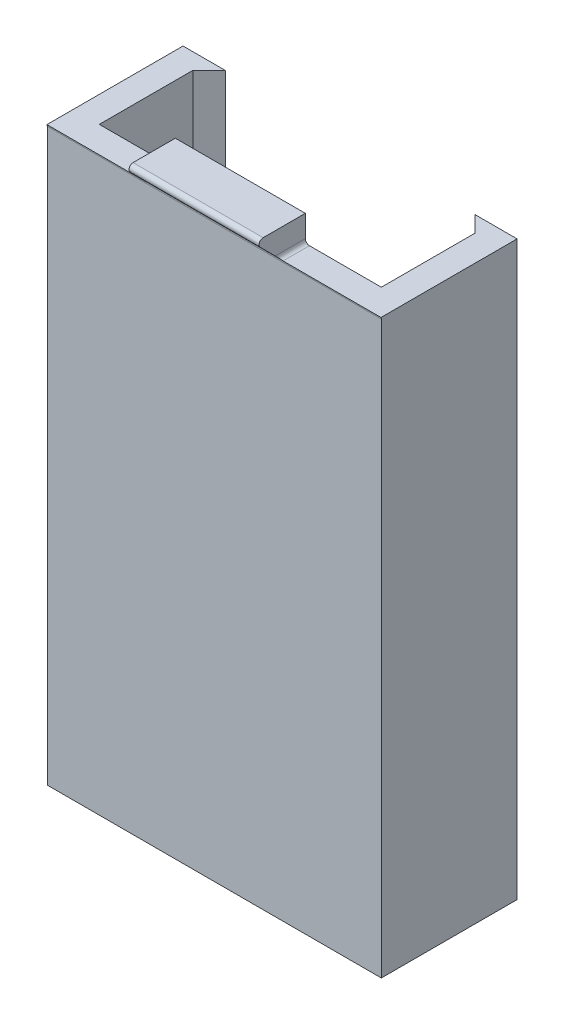
ISO-10303-21;
HEADER;
FILE_DESCRIPTION(('STEP AP214'),'2;1');
FILE_NAME('part.step','',(''),(''),'','','');
FILE_SCHEMA(('AUTOMOTIVE_DESIGN { 1 0 10303 214 1 1 1 1 }'));
ENDSEC;
DATA;
#1=APPLICATION_CONTEXT('core data for automotive mechanical design processes');
#2=APPLICATION_PROTOCOL_DEFINITION('international standard','automotive_design',2000,#1);
#3=PRODUCT_CONTEXT('',#1,'mechanical');
#4=PRODUCT('Part','Part','',(#3));
#5=PRODUCT_RELATED_PRODUCT_CATEGORY('part','',(#4));
#6=PRODUCT_DEFINITION_FORMATION('','',#4);
#7=PRODUCT_DEFINITION_CONTEXT('part definition',#1,'design');
#8=PRODUCT_DEFINITION('design','',#6,#7);
#9=PRODUCT_DEFINITION_SHAPE('','',#8);
#10=(LENGTH_UNIT() NAMED_UNIT(*) SI_UNIT(.MILLI.,.METRE.));
#11=(NAMED_UNIT(*) PLANE_ANGLE_UNIT() SI_UNIT($,.RADIAN.));
#12=(NAMED_UNIT(*) SI_UNIT($,.STERADIAN.) SOLID_ANGLE_UNIT());
#13=UNCERTAINTY_MEASURE_WITH_UNIT(LENGTH_MEASURE(1.E-05),#10,'distance_accuracy_value','');
#14=(GEOMETRIC_REPRESENTATION_CONTEXT(3) GLOBAL_UNCERTAINTY_ASSIGNED_CONTEXT((#13)) GLOBAL_UNIT_ASSIGNED_CONTEXT((#10,
#11,#12)) REPRESENTATION_CONTEXT('',''));
#15=CARTESIAN_POINT('',(0.,0.,0.));
#16=DIRECTION('',(0.,0.,1.));
#17=DIRECTION('',(1.,0.,0.));
#18=AXIS2_PLACEMENT_3D('',#15,#16,#17);
#19=CARTESIAN_POINT('',(0.,17.6,0.));
#20=DIRECTION('',(0.,1.,0.));
#21=DIRECTION('',(0.,0.,1.));
#22=AXIS2_PLACEMENT_3D('',#19,#20,#21);
#23=PLANE('',#22);
#24=DIRECTION('',(0.,0.,1.));
#25=VECTOR('',#24,1.);
#26=CARTESIAN_POINT('',(-10.275,17.6,-3.375));
#27=LINE('',#26,#25);
#28=CARTESIAN_POINT('',(-10.275,17.6,-3.375));
#29=VERTEX_POINT('',#28);
#30=CARTESIAN_POINT('',(-10.275,17.6,4.99745506971827));
#31=VERTEX_POINT('',#30);
#32=EDGE_CURVE('E73',#29,#31,#27,.T.);
#33=ORIENTED_EDGE('',*,*,#32,.T.);
#34=DIRECTION('',(1.,0.,0.));
#35=VECTOR('',#34,1.);
#36=CARTESIAN_POINT('',(-10.275,17.6,4.99745506971827));
#37=LINE('',#36,#35);
#38=CARTESIAN_POINT('',(-4.25,17.6,4.99745506971889));
#39=VERTEX_POINT('',#38);
#40=EDGE_CURVE('E371',#31,#39,#37,.T.);
#41=ORIENTED_EDGE('',*,*,#40,.T.);
#42=DIRECTION('',(0.,0.,-1.));
#43=VECTOR('',#42,1.);
#44=CARTESIAN_POINT('',(-4.25,17.6,3.375));
#45=LINE('',#44,#43);
#46=CARTESIAN_POINT('',(-4.25,17.6,3.375));
#47=VERTEX_POINT('',#46);
#48=EDGE_CURVE('E325',#39,#47,#45,.T.);
#49=ORIENTED_EDGE('',*,*,#48,.T.);
#50=DIRECTION('',(-1.,0.,0.));
#51=VECTOR('',#50,1.);
#52=CARTESIAN_POINT('',(-8.675,17.6,3.375));
#53=LINE('',#52,#51);
#54=CARTESIAN_POINT('',(-8.675,17.6,3.375));
#55=VERTEX_POINT('',#54);
#56=EDGE_CURVE('E269',#47,#55,#53,.T.);
#57=ORIENTED_EDGE('',*,*,#56,.T.);
#58=DIRECTION('',(0.,0.,-1.));
#59=VECTOR('',#58,1.);
#60=CARTESIAN_POINT('',(-8.675,17.6,-3.375));
#61=LINE('',#60,#59);
#62=CARTESIAN_POINT('',(-8.675,17.6,-2.375));
#63=VERTEX_POINT('',#62);
#64=EDGE_CURVE('E274',#55,#63,#61,.T.);
#65=ORIENTED_EDGE('',*,*,#64,.T.);
#66=DIRECTION('',(0.707106781186544,0.,-0.707106781186552));
#67=VECTOR('',#66,1.);
#68=CARTESIAN_POINT('',(-8.675,17.6,-2.375));
#69=LINE('',#68,#67);
#70=CARTESIAN_POINT('',(-7.67500000000001,17.6,-3.375));
#71=VERTEX_POINT('',#70);
#72=EDGE_CURVE('E239',#63,#71,#69,.T.);
#73=ORIENTED_EDGE('',*,*,#72,.T.);
#74=DIRECTION('',(-1.,0.,0.));
#75=VECTOR('',#74,1.);
#76=CARTESIAN_POINT('',(-8.675,17.6,-3.375));
#77=LINE('',#76,#75);
#78=EDGE_CURVE('E255',#71,#29,#77,.T.);
#79=ORIENTED_EDGE('',*,*,#78,.T.);
#80=EDGE_LOOP('',(#33,#41,#49,#57,#65,#73,#79));
#81=FACE_BOUND('',#80,.T.);
#82=ADVANCED_FACE('F43',(#81),#23,.T.);
#83=CARTESIAN_POINT('',(8.675,17.6,3.375));
#84=DIRECTION('',(1.,0.,0.));
#85=DIRECTION('',(0.,0.,-1.));
#86=AXIS2_PLACEMENT_3D('',#83,#84,#85);
#87=PLANE('',#86);
#88=DIRECTION('',(0.,-1.,0.));
#89=VECTOR('',#88,1.);
#90=CARTESIAN_POINT('',(8.675,17.6,-2.375));
#91=LINE('',#90,#89);
#92=CARTESIAN_POINT('',(8.675,17.6,-2.375));
#93=VERTEX_POINT('',#92);
#94=CARTESIAN_POINT('',(8.675,-17.6,-2.375));
#95=VERTEX_POINT('',#94);
#96=EDGE_CURVE('E226',#93,#95,#91,.T.);
#97=ORIENTED_EDGE('',*,*,#96,.T.);
#98=DIRECTION('',(0.,0.,1.));
#99=VECTOR('',#98,1.);
#100=CARTESIAN_POINT('',(8.675,-17.6,3.375));
#101=LINE('',#100,#99);
#102=CARTESIAN_POINT('',(8.675,-17.6,3.375));
#103=VERTEX_POINT('',#102);
#104=EDGE_CURVE('E296',#95,#103,#101,.T.);
#105=ORIENTED_EDGE('',*,*,#104,.T.);
#106=DIRECTION('',(0.,-1.,0.));
#107=VECTOR('',#106,1.);
#108=CARTESIAN_POINT('',(8.675,17.6,3.375));
#109=LINE('',#108,#107);
#110=CARTESIAN_POINT('',(8.675,17.6,3.375));
#111=VERTEX_POINT('',#110);
#112=EDGE_CURVE('E307',#111,#103,#109,.T.);
#113=ORIENTED_EDGE('',*,*,#112,.F.);
#114=DIRECTION('',(0.,0.,1.));
#115=VECTOR('',#114,1.);
#116=CARTESIAN_POINT('',(8.675,17.6,3.375));
#117=LINE('',#116,#115);
#118=EDGE_CURVE('E266',#93,#111,#117,.T.);
#119=ORIENTED_EDGE('',*,*,#118,.F.);
#120=EDGE_LOOP('',(#97,#105,#113,#119));
#121=FACE_BOUND('',#120,.T.);
#122=ADVANCED_FACE('F403',(#121),#87,.F.);
#123=CARTESIAN_POINT('',(-8.675,17.6,-3.375));
#124=DIRECTION('',(-1.,0.,0.));
#125=DIRECTION('',(0.,0.,1.));
#126=AXIS2_PLACEMENT_3D('',#123,#124,#125);
#127=PLANE('',#126);
#128=DIRECTION('',(0.,-1.,0.));
#129=VECTOR('',#128,1.);
#130=CARTESIAN_POINT('',(-8.675,17.6,-2.375));
#131=LINE('',#130,#129);
#132=CARTESIAN_POINT('',(-8.675,-17.6,-2.375));
#133=VERTEX_POINT('',#132);
#134=EDGE_CURVE('E250',#63,#133,#131,.T.);
#135=ORIENTED_EDGE('',*,*,#134,.F.);
#136=ORIENTED_EDGE('',*,*,#64,.F.);
#137=DIRECTION('',(0.,-1.,0.));
#138=VECTOR('',#137,1.);
#139=CARTESIAN_POINT('',(-8.675,17.6,3.375));
#140=LINE('',#139,#138);
#141=CARTESIAN_POINT('',(-8.675,-17.6,3.375));
#142=VERTEX_POINT('',#141);
#143=EDGE_CURVE('E278',#55,#142,#140,.T.);
#144=ORIENTED_EDGE('',*,*,#143,.T.);
#145=DIRECTION('',(0.,0.,-1.));
#146=VECTOR('',#145,1.);
#147=CARTESIAN_POINT('',(-8.675,-17.6,-3.375));
#148=LINE('',#147,#146);
#149=EDGE_CURVE('E258',#142,#133,#148,.T.);
#150=ORIENTED_EDGE('',*,*,#149,.T.);
#151=EDGE_LOOP('',(#135,#136,#144,#150));
#152=FACE_BOUND('',#151,.T.);
#153=ADVANCED_FACE('F411',(#152),#127,.F.);
#154=CARTESIAN_POINT('',(-8.675,17.6,-3.375));
#155=DIRECTION('',(0.,0.,1.));
#156=DIRECTION('',(1.,0.,0.));
#157=AXIS2_PLACEMENT_3D('',#154,#155,#156);
#158=PLANE('',#157);
#159=DIRECTION('',(-1.,0.,0.));
#160=VECTOR('',#159,1.);
#161=CARTESIAN_POINT('',(-8.675,-17.6,-3.375));
#162=LINE('',#161,#160);
#163=CARTESIAN_POINT('',(-7.67500000000001,-17.6,-3.375));
#164=VERTEX_POINT('',#163);
#165=CARTESIAN_POINT('',(-10.275,-17.6,-3.375));
#166=VERTEX_POINT('',#165);
#167=EDGE_CURVE('E254',#164,#166,#162,.T.);
#168=ORIENTED_EDGE('',*,*,#167,.T.);
#169=DIRECTION('',(0.,-1.,0.));
#170=VECTOR('',#169,1.);
#171=CARTESIAN_POINT('',(-10.275,17.6,-3.375));
#172=LINE('',#171,#170);
#173=EDGE_CURVE('E321',#29,#166,#172,.T.);
#174=ORIENTED_EDGE('',*,*,#173,.F.);
#175=ORIENTED_EDGE('',*,*,#78,.F.);
#176=DIRECTION('',(0.,-1.,0.));
#177=VECTOR('',#176,1.);
#178=CARTESIAN_POINT('',(-7.67500000000001,17.6,-3.375));
#179=LINE('',#178,#177);
#180=EDGE_CURVE('E243',#71,#164,#179,.T.);
#181=ORIENTED_EDGE('',*,*,#180,.T.);
#182=EDGE_LOOP('',(#168,#174,#175,#181));
#183=FACE_BOUND('',#182,.T.);
#184=ADVANCED_FACE('F587',(#183),#158,.F.);
#185=CARTESIAN_POINT('',(-10.275,17.6,-3.375));
#186=DIRECTION('',(1.,0.,0.));
#187=DIRECTION('',(0.,0.,-1.));
#188=AXIS2_PLACEMENT_3D('',#185,#186,#187);
#189=PLANE('',#188);
#190=DIRECTION('',(0.,0.,1.));
#191=VECTOR('',#190,1.);
#192=CARTESIAN_POINT('',(-10.275,-17.6,-3.375));
#193=LINE('',#192,#191);
#194=CARTESIAN_POINT('',(-10.275,-17.6,4.975));
#195=VERTEX_POINT('',#194);
#196=EDGE_CURVE('E282',#166,#195,#193,.T.);
#197=ORIENTED_EDGE('',*,*,#196,.T.);
#198=DIRECTION('',(0.,-1.,0.));
#199=VECTOR('',#198,1.);
#200=CARTESIAN_POINT('',(-10.275,17.6,4.975));
#201=LINE('',#200,#199);
#202=CARTESIAN_POINT('',(-10.275,17.4964466094067,4.975));
#203=VERTEX_POINT('',#202);
#204=EDGE_CURVE('E318',#203,#195,#201,.T.);
#205=ORIENTED_EDGE('',*,*,#204,.F.);
#206=CARTESIAN_POINT('',(-10.275,17.4964466094067,5.225));
#207=DIRECTION('',(1.,0.,0.));
#208=DIRECTION('',(0.,0.,-1.));
#209=AXIS2_PLACEMENT_3D('',#206,#207,#208);
#210=CIRCLE('',#209,0.25);
#211=EDGE_CURVE('E368',#203,#31,#210,.T.);
#212=ORIENTED_EDGE('',*,*,#211,.T.);
#213=ORIENTED_EDGE('',*,*,#32,.F.);
#214=ORIENTED_EDGE('',*,*,#173,.T.);
#215=EDGE_LOOP('',(#197,#205,#212,#213,#214));
#216=FACE_BOUND('',#215,.T.);
#217=ADVANCED_FACE('F577',(#216),#189,.F.);
#218=CARTESIAN_POINT('',(-10.275,17.6,4.975));
#219=DIRECTION('',(0.,0.,-1.));
#220=DIRECTION('',(-1.,0.,0.));
#221=AXIS2_PLACEMENT_3D('',#218,#219,#220);
#222=PLANE('',#221);
#223=DIRECTION('',(0.,-1.,0.));
#224=VECTOR('',#223,1.);
#225=CARTESIAN_POINT('',(10.275,17.6,4.975));
#226=LINE('',#225,#224);
#227=CARTESIAN_POINT('',(10.275,17.4964466094067,4.975));
#228=VERTEX_POINT('',#227);
#229=CARTESIAN_POINT('',(10.275,-17.6,4.975));
#230=VERTEX_POINT('',#229);
#231=EDGE_CURVE('E315',#228,#230,#226,.T.);
#232=ORIENTED_EDGE('',*,*,#231,.F.);
#233=DIRECTION('',(-1.,0.,0.));
#234=VECTOR('',#233,1.);
#235=CARTESIAN_POINT('',(-4.,17.4964466094067,4.975));
#236=LINE('',#235,#234);
#237=EDGE_CURVE('E343',#228,#203,#236,.T.);
#238=ORIENTED_EDGE('',*,*,#237,.T.);
#239=ORIENTED_EDGE('',*,*,#204,.T.);
#240=DIRECTION('',(1.,0.,0.));
#241=VECTOR('',#240,1.);
#242=CARTESIAN_POINT('',(-10.275,-17.6,4.975));
#243=LINE('',#242,#241);
#244=EDGE_CURVE('E286',#195,#230,#243,.T.);
#245=ORIENTED_EDGE('',*,*,#244,.T.);
#246=EDGE_LOOP('',(#232,#238,#239,#245));
#247=FACE_BOUND('',#246,.T.);
#248=ADVANCED_FACE('F566',(#247),#222,.F.);
#249=CARTESIAN_POINT('',(10.275,17.6,4.975));
#250=DIRECTION('',(-1.,0.,0.));
#251=DIRECTION('',(0.,0.,1.));
#252=AXIS2_PLACEMENT_3D('',#249,#250,#251);
#253=PLANE('',#252);
#254=DIRECTION('',(0.,0.,-1.));
#255=VECTOR('',#254,1.);
#256=CARTESIAN_POINT('',(10.275,-17.6,4.975));
#257=LINE('',#256,#255);
#258=CARTESIAN_POINT('',(10.275,-17.6,-3.375));
#259=VERTEX_POINT('',#258);
#260=EDGE_CURVE('E290',#230,#259,#257,.T.);
#261=ORIENTED_EDGE('',*,*,#260,.T.);
#262=DIRECTION('',(0.,-1.,0.));
#263=VECTOR('',#262,1.);
#264=CARTESIAN_POINT('',(10.275,17.6,-3.375));
#265=LINE('',#264,#263);
#266=CARTESIAN_POINT('',(10.275,17.6,-3.375));
#267=VERTEX_POINT('',#266);
#268=EDGE_CURVE('E311',#267,#259,#265,.T.);
#269=ORIENTED_EDGE('',*,*,#268,.F.);
#270=DIRECTION('',(0.,0.,-1.));
#271=VECTOR('',#270,1.);
#272=CARTESIAN_POINT('',(10.275,17.6,4.975));
#273=LINE('',#272,#271);
#274=CARTESIAN_POINT('',(10.275,17.6,4.99745506971827));
#275=VERTEX_POINT('',#274);
#276=EDGE_CURVE('E65',#275,#267,#273,.T.);
#277=ORIENTED_EDGE('',*,*,#276,.F.);
#278=CARTESIAN_POINT('',(10.275,17.4964466094067,5.225));
#279=DIRECTION('',(-1.,0.,0.));
#280=DIRECTION('',(0.,0.,1.));
#281=AXIS2_PLACEMENT_3D('',#278,#279,#280);
#282=CIRCLE('',#281,0.25);
#283=EDGE_CURVE('E11',#275,#228,#282,.T.);
#284=ORIENTED_EDGE('',*,*,#283,.T.);
#285=ORIENTED_EDGE('',*,*,#231,.T.);
#286=EDGE_LOOP('',(#261,#269,#277,#284,#285));
#287=FACE_BOUND('',#286,.T.);
#288=ADVANCED_FACE('F441',(#287),#253,.F.);
#289=CARTESIAN_POINT('',(10.275,17.6,-3.375));
#290=DIRECTION('',(0.,0.,1.));
#291=DIRECTION('',(1.,0.,0.));
#292=AXIS2_PLACEMENT_3D('',#289,#290,#291);
#293=PLANE('',#292);
#294=DIRECTION('',(-1.,0.,0.));
#295=VECTOR('',#294,1.);
#296=CARTESIAN_POINT('',(10.275,-17.6,-3.375));
#297=LINE('',#296,#295);
#298=CARTESIAN_POINT('',(7.67500000000001,-17.6,-3.375));
#299=VERTEX_POINT('',#298);
#300=EDGE_CURVE('E293',#259,#299,#297,.T.);
#301=ORIENTED_EDGE('',*,*,#300,.T.);
#302=DIRECTION('',(0.,-1.,0.));
#303=VECTOR('',#302,1.);
#304=CARTESIAN_POINT('',(7.67500000000001,17.6,-3.375));
#305=LINE('',#304,#303);
#306=CARTESIAN_POINT('',(7.67500000000001,17.6,-3.375));
#307=VERTEX_POINT('',#306);
#308=EDGE_CURVE('E205',#307,#299,#305,.T.);
#309=ORIENTED_EDGE('',*,*,#308,.F.);
#310=DIRECTION('',(-1.,0.,0.));
#311=VECTOR('',#310,1.);
#312=CARTESIAN_POINT('',(10.275,17.6,-3.375));
#313=LINE('',#312,#311);
#314=EDGE_CURVE('E263',#267,#307,#313,.T.);
#315=ORIENTED_EDGE('',*,*,#314,.F.);
#316=ORIENTED_EDGE('',*,*,#268,.T.);
#317=EDGE_LOOP('',(#301,#309,#315,#316));
#318=FACE_BOUND('',#317,.T.);
#319=ADVANCED_FACE('F427',(#318),#293,.F.);
#320=CARTESIAN_POINT('',(-8.675,17.6,3.375));
#321=DIRECTION('',(0.,0.,1.));
#322=DIRECTION('',(1.,0.,0.));
#323=AXIS2_PLACEMENT_3D('',#320,#321,#322);
#324=PLANE('',#323);
#325=DIRECTION('',(-1.,0.,0.));
#326=VECTOR('',#325,1.);
#327=CARTESIAN_POINT('',(-8.675,-17.6,3.375));
#328=LINE('',#327,#326);
#329=EDGE_CURVE('E299',#103,#142,#328,.T.);
#330=ORIENTED_EDGE('',*,*,#329,.T.);
#331=ORIENTED_EDGE('',*,*,#143,.F.);
#332=ORIENTED_EDGE('',*,*,#56,.F.);
#333=CARTESIAN_POINT('',(-4.25,17.85,3.375));
#334=DIRECTION('',(0.,0.,1.));
#335=DIRECTION('',(1.,0.,0.));
#336=AXIS2_PLACEMENT_3D('',#333,#334,#335);
#337=CIRCLE('',#336,0.25);
#338=CARTESIAN_POINT('',(-4.,17.85,3.375));
#339=VERTEX_POINT('',#338);
#340=EDGE_CURVE('E355',#47,#339,#337,.T.);
#341=ORIENTED_EDGE('',*,*,#340,.T.);
#342=DIRECTION('',(0.,1.,0.));
#343=VECTOR('',#342,1.);
#344=CARTESIAN_POINT('',(-4.,19.2,3.375));
#345=LINE('',#344,#343);
#346=CARTESIAN_POINT('',(-4.,19.2,3.375));
#347=VERTEX_POINT('',#346);
#348=EDGE_CURVE('E200',#339,#347,#345,.T.);
#349=ORIENTED_EDGE('',*,*,#348,.T.);
#350=DIRECTION('',(-1.,0.,0.));
#351=VECTOR('',#350,1.);
#352=CARTESIAN_POINT('',(4.,19.2,3.375));
#353=LINE('',#352,#351);
#354=CARTESIAN_POINT('',(4.,19.2,3.375));
#355=VERTEX_POINT('',#354);
#356=EDGE_CURVE('E197',#355,#347,#353,.T.);
#357=ORIENTED_EDGE('',*,*,#356,.F.);
#358=DIRECTION('',(0.,1.,0.));
#359=VECTOR('',#358,1.);
#360=CARTESIAN_POINT('',(4.,19.2,3.375));
#361=LINE('',#360,#359);
#362=CARTESIAN_POINT('',(4.,17.85,3.375));
#363=VERTEX_POINT('',#362);
#364=EDGE_CURVE('E182',#363,#355,#361,.T.);
#365=ORIENTED_EDGE('',*,*,#364,.F.);
#366=CARTESIAN_POINT('',(4.25,17.85,3.375));
#367=DIRECTION('',(0.,0.,1.));
#368=DIRECTION('',(1.,0.,0.));
#369=AXIS2_PLACEMENT_3D('',#366,#367,#368);
#370=CIRCLE('',#369,0.25);
#371=CARTESIAN_POINT('',(4.25,17.6,3.375));
#372=VERTEX_POINT('',#371);
#373=EDGE_CURVE('E362',#363,#372,#370,.T.);
#374=ORIENTED_EDGE('',*,*,#373,.T.);
#375=EDGE_CURVE('E270',#111,#372,#53,.T.);
#376=ORIENTED_EDGE('',*,*,#375,.F.);
#377=ORIENTED_EDGE('',*,*,#112,.T.);
#378=EDGE_LOOP('',(#330,#331,#332,#341,#349,#357,#365,#374,#376,#377));
#379=FACE_BOUND('',#378,.T.);
#380=ADVANCED_FACE('F198',(#379),#324,.F.);
#381=ORIENTED_EDGE('',*,*,#375,.T.);
#382=DIRECTION('',(0.,0.,-1.));
#383=VECTOR('',#382,1.);
#384=CARTESIAN_POINT('',(4.25,17.6,0.));
#385=LINE('',#384,#383);
#386=CARTESIAN_POINT('',(4.25,17.6,4.99745506971889));
#387=VERTEX_POINT('',#386);
#388=EDGE_CURVE('E340',#372,#387,#385,.F.);
#389=ORIENTED_EDGE('',*,*,#388,.T.);
#390=DIRECTION('',(1.,0.,0.));
#391=VECTOR('',#390,1.);
#392=CARTESIAN_POINT('',(4.25,17.6,4.99745506971889));
#393=LINE('',#392,#391);
#394=EDGE_CURVE('E58',#387,#275,#393,.T.);
#395=ORIENTED_EDGE('',*,*,#394,.T.);
#396=ORIENTED_EDGE('',*,*,#276,.T.);
#397=ORIENTED_EDGE('',*,*,#314,.T.);
#398=DIRECTION('',(0.707106781186544,0.,0.707106781186552));
#399=VECTOR('',#398,1.);
#400=CARTESIAN_POINT('',(8.675,17.6,-2.375));
#401=LINE('',#400,#399);
#402=EDGE_CURVE('E230',#307,#93,#401,.T.);
#403=ORIENTED_EDGE('',*,*,#402,.T.);
#404=ORIENTED_EDGE('',*,*,#118,.T.);
#405=EDGE_LOOP('',(#381,#389,#395,#396,#397,#403,#404));
#406=FACE_BOUND('',#405,.T.);
#407=ADVANCED_FACE('F405',(#406),#23,.T.);
#408=CARTESIAN_POINT('',(0.,-17.6,0.));
#409=DIRECTION('',(0.,1.,0.));
#410=DIRECTION('',(0.,0.,1.));
#411=AXIS2_PLACEMENT_3D('',#408,#409,#410);
#412=PLANE('',#411);
#413=ORIENTED_EDGE('',*,*,#167,.F.);
#414=DIRECTION('',(0.707106781186544,0.,-0.707106781186552));
#415=VECTOR('',#414,1.);
#416=CARTESIAN_POINT('',(-8.675,-17.6,-2.375));
#417=LINE('',#416,#415);
#418=EDGE_CURVE('E235',#133,#164,#417,.T.);
#419=ORIENTED_EDGE('',*,*,#418,.F.);
#420=ORIENTED_EDGE('',*,*,#149,.F.);
#421=ORIENTED_EDGE('',*,*,#329,.F.);
#422=ORIENTED_EDGE('',*,*,#104,.F.);
#423=DIRECTION('',(0.707106781186544,0.,0.707106781186552));
#424=VECTOR('',#423,1.);
#425=CARTESIAN_POINT('',(8.675,-17.6,-2.375));
#426=LINE('',#425,#424);
#427=EDGE_CURVE('E231',#299,#95,#426,.T.);
#428=ORIENTED_EDGE('',*,*,#427,.F.);
#429=ORIENTED_EDGE('',*,*,#300,.F.);
#430=ORIENTED_EDGE('',*,*,#260,.F.);
#431=ORIENTED_EDGE('',*,*,#244,.F.);
#432=ORIENTED_EDGE('',*,*,#196,.F.);
#433=EDGE_LOOP('',(#413,#419,#420,#421,#422,#428,#429,#430,#431,#432));
#434=FACE_BOUND('',#433,.T.);
#435=ADVANCED_FACE('F417',(#434),#412,.F.);
#436=CARTESIAN_POINT('',(-8.675,17.6,-2.375));
#437=DIRECTION('',(-0.707106781186552,0.,-0.707106781186544));
#438=DIRECTION('',(-0.707106781186544,0.,0.707106781186552));
#439=AXIS2_PLACEMENT_3D('',#436,#437,#438);
#440=PLANE('',#439);
#441=ORIENTED_EDGE('',*,*,#418,.T.);
#442=ORIENTED_EDGE('',*,*,#180,.F.);
#443=ORIENTED_EDGE('',*,*,#72,.F.);
#444=ORIENTED_EDGE('',*,*,#134,.T.);
#445=EDGE_LOOP('',(#441,#442,#443,#444));
#446=FACE_BOUND('',#445,.T.);
#447=ADVANCED_FACE('F424',(#446),#440,.F.);
#448=CARTESIAN_POINT('',(8.675,17.6,-2.375));
#449=DIRECTION('',(0.707106781186552,0.,-0.707106781186544));
#450=DIRECTION('',(-0.707106781186544,0.,-0.707106781186552));
#451=AXIS2_PLACEMENT_3D('',#448,#449,#450);
#452=PLANE('',#451);
#453=ORIENTED_EDGE('',*,*,#427,.T.);
#454=ORIENTED_EDGE('',*,*,#96,.F.);
#455=ORIENTED_EDGE('',*,*,#402,.F.);
#456=ORIENTED_EDGE('',*,*,#308,.T.);
#457=EDGE_LOOP('',(#453,#454,#455,#456));
#458=FACE_BOUND('',#457,.T.);
#459=ADVANCED_FACE('F448',(#458),#452,.F.);
#460=CARTESIAN_POINT('',(4.,17.6,4.975));
#461=DIRECTION('',(0.,0.707106781186546,-0.707106781186549));
#462=DIRECTION('',(0.,0.707106781186549,0.707106781186546));
#463=AXIS2_PLACEMENT_3D('',#460,#461,#462);
#464=PLANE('',#463);
#465=CARTESIAN_POINT('',(-4.25,17.85,5.225));
#466=DIRECTION('',(0.,0.707106781186546,-0.707106781186549));
#467=DIRECTION('',(0.,0.707106781186549,0.707106781186546));
#468=AXIS2_PLACEMENT_3D('',#465,#466,#467);
#469=ELLIPSE('',#468,0.353553390593273,0.25);
#470=CARTESIAN_POINT('',(-4.,17.85,5.225));
#471=VERTEX_POINT('',#470);
#472=CARTESIAN_POINT('',(-4.07322330470336,17.6732233047034,5.04822330470336));
#473=VERTEX_POINT('',#472);
#474=EDGE_CURVE('E358',#471,#473,#469,.T.);
#475=ORIENTED_EDGE('',*,*,#474,.T.);
#476=DIRECTION('',(-1.,0.,0.));
#477=VECTOR('',#476,1.);
#478=CARTESIAN_POINT('',(4.,17.6732233047034,5.04822330470336));
#479=LINE('',#478,#477);
#480=CARTESIAN_POINT('',(4.07322330470336,17.6732233047034,5.04822330470336));
#481=VERTEX_POINT('',#480);
#482=EDGE_CURVE('E350',#473,#481,#479,.F.);
#483=ORIENTED_EDGE('',*,*,#482,.T.);
#484=CARTESIAN_POINT('',(4.25,17.85,5.225));
#485=DIRECTION('',(0.,0.707106781186546,-0.707106781186549));
#486=DIRECTION('',(0.,-0.707106781186549,-0.707106781186546));
#487=AXIS2_PLACEMENT_3D('',#484,#485,#486);
#488=ELLIPSE('',#487,0.353553390593273,0.25);
#489=CARTESIAN_POINT('',(4.,17.85,5.225));
#490=VERTEX_POINT('',#489);
#491=EDGE_CURVE('E365',#481,#490,#488,.T.);
#492=ORIENTED_EDGE('',*,*,#491,.T.);
#493=DIRECTION('',(0.,-0.707106781186549,-0.707106781186546));
#494=VECTOR('',#493,1.);
#495=CARTESIAN_POINT('',(4.,17.6,4.975));
#496=LINE('',#495,#494);
#497=CARTESIAN_POINT('',(4.,18.7732233047034,6.14822330470336));
#498=VERTEX_POINT('',#497);
#499=EDGE_CURVE('E194',#498,#490,#496,.T.);
#500=ORIENTED_EDGE('',*,*,#499,.F.);
#501=DIRECTION('',(-1.,0.,0.));
#502=VECTOR('',#501,1.);
#503=CARTESIAN_POINT('',(4.,18.7732233047034,6.14822330470336));
#504=LINE('',#503,#502);
#505=CARTESIAN_POINT('',(-4.,18.7732233047034,6.14822330470336));
#506=VERTEX_POINT('',#505);
#507=EDGE_CURVE('E346',#498,#506,#504,.T.);
#508=ORIENTED_EDGE('',*,*,#507,.T.);
#509=DIRECTION('',(0.,-0.707106781186549,-0.707106781186546));
#510=VECTOR('',#509,1.);
#511=CARTESIAN_POINT('',(-4.,17.6,4.975));
#512=LINE('',#511,#510);
#513=EDGE_CURVE('E214',#506,#471,#512,.T.);
#514=ORIENTED_EDGE('',*,*,#513,.T.);
#515=EDGE_LOOP('',(#475,#483,#492,#500,#508,#514));
#516=FACE_BOUND('',#515,.T.);
#517=ADVANCED_FACE('F467',(#516),#464,.F.);
#518=CARTESIAN_POINT('',(4.,19.2,6.575));
#519=DIRECTION('',(0.,-1.,0.));
#520=DIRECTION('',(0.,0.,-1.));
#521=AXIS2_PLACEMENT_3D('',#518,#519,#520);
#522=PLANE('',#521);
#523=DIRECTION('',(0.,0.,1.));
#524=VECTOR('',#523,1.);
#525=CARTESIAN_POINT('',(-4.,19.2,6.575));
#526=LINE('',#525,#524);
#527=CARTESIAN_POINT('',(-4.,19.2,5.97144660940672));
#528=VERTEX_POINT('',#527);
#529=EDGE_CURVE('E220',#347,#528,#526,.T.);
#530=ORIENTED_EDGE('',*,*,#529,.T.);
#531=DIRECTION('',(-1.,0.,0.));
#532=VECTOR('',#531,1.);
#533=CARTESIAN_POINT('',(4.,19.2,5.97144660940672));
#534=LINE('',#533,#532);
#535=CARTESIAN_POINT('',(4.,19.2,5.97144660940672));
#536=VERTEX_POINT('',#535);
#537=EDGE_CURVE('E209',#528,#536,#534,.F.);
#538=ORIENTED_EDGE('',*,*,#537,.T.);
#539=DIRECTION('',(0.,0.,1.));
#540=VECTOR('',#539,1.);
#541=CARTESIAN_POINT('',(4.,19.2,6.575));
#542=LINE('',#541,#540);
#543=EDGE_CURVE('E187',#355,#536,#542,.T.);
#544=ORIENTED_EDGE('',*,*,#543,.F.);
#545=ORIENTED_EDGE('',*,*,#356,.T.);
#546=EDGE_LOOP('',(#530,#538,#544,#545));
#547=FACE_BOUND('',#546,.T.);
#548=ADVANCED_FACE('F207',(#547),#522,.F.);
#549=CARTESIAN_POINT('',(4.,0.,0.));
#550=DIRECTION('',(-1.,0.,0.));
#551=DIRECTION('',(0.,0.,1.));
#552=AXIS2_PLACEMENT_3D('',#549,#550,#551);
#553=PLANE('',#552);
#554=ORIENTED_EDGE('',*,*,#499,.T.);
#555=DIRECTION('',(0.,0.,-1.));
#556=VECTOR('',#555,1.);
#557=CARTESIAN_POINT('',(4.,17.85,0.));
#558=LINE('',#557,#556);
#559=EDGE_CURVE('E190',#490,#363,#558,.T.);
#560=ORIENTED_EDGE('',*,*,#559,.T.);
#561=ORIENTED_EDGE('',*,*,#364,.T.);
#562=ORIENTED_EDGE('',*,*,#543,.T.);
#563=CARTESIAN_POINT('',(4.,18.95,5.97144660940672));
#564=DIRECTION('',(-1.,0.,0.));
#565=DIRECTION('',(0.,0.,1.));
#566=AXIS2_PLACEMENT_3D('',#563,#564,#565);
#567=CIRCLE('',#566,0.25);
#568=EDGE_CURVE('E335',#536,#498,#567,.F.);
#569=ORIENTED_EDGE('',*,*,#568,.T.);
#570=EDGE_LOOP('',(#554,#560,#561,#562,#569));
#571=FACE_BOUND('',#570,.T.);
#572=ADVANCED_FACE('F185',(#571),#553,.F.);
#573=CARTESIAN_POINT('',(-4.,0.,0.));
#574=DIRECTION('',(-1.,0.,0.));
#575=DIRECTION('',(0.,0.,1.));
#576=AXIS2_PLACEMENT_3D('',#573,#574,#575);
#577=PLANE('',#576);
#578=ORIENTED_EDGE('',*,*,#348,.F.);
#579=DIRECTION('',(0.,0.,-1.));
#580=VECTOR('',#579,1.);
#581=CARTESIAN_POINT('',(-4.,17.85,4.975));
#582=LINE('',#581,#580);
#583=EDGE_CURVE('E332',#339,#471,#582,.F.);
#584=ORIENTED_EDGE('',*,*,#583,.T.);
#585=ORIENTED_EDGE('',*,*,#513,.F.);
#586=CARTESIAN_POINT('',(-4.,18.95,5.97144660940672));
#587=DIRECTION('',(-1.,0.,0.));
#588=DIRECTION('',(0.,0.,1.));
#589=AXIS2_PLACEMENT_3D('',#586,#587,#588);
#590=CIRCLE('',#589,0.25);
#591=EDGE_CURVE('E329',#506,#528,#590,.T.);
#592=ORIENTED_EDGE('',*,*,#591,.T.);
#593=ORIENTED_EDGE('',*,*,#529,.F.);
#594=EDGE_LOOP('',(#578,#584,#585,#592,#593));
#595=FACE_BOUND('',#594,.T.);
#596=ADVANCED_FACE('F393',(#595),#577,.T.);
#597=CARTESIAN_POINT('',(4.25,17.85,0.));
#598=DIRECTION('',(0.,0.,-1.));
#599=DIRECTION('',(-1.,0.,0.));
#600=AXIS2_PLACEMENT_3D('',#597,#598,#599);
#601=CYLINDRICAL_SURFACE('',#600,0.25);
#602=ORIENTED_EDGE('',*,*,#559,.F.);
#603=ORIENTED_EDGE('',*,*,#491,.F.);
#604=CARTESIAN_POINT('',(4.25,17.6,4.99745506971889));
#605=CARTESIAN_POINT('',(4.23768855182279,17.5999845220819,4.99747587488827));
#606=CARTESIAN_POINT('',(4.22537197353927,17.6009086459914,4.9978694638652));
#607=CARTESIAN_POINT('',(4.20103717872159,17.6045366270755,4.99955828689399));
#608=CARTESIAN_POINT('',(4.18901976101059,17.6072448088768,5.00085571232144));
#609=CARTESIAN_POINT('',(4.165622029583,17.6143505565599,5.0045148658897));
#610=CARTESIAN_POINT('',(4.15424361665906,17.6187528853701,5.00687959792765));
#611=CARTESIAN_POINT('',(4.13255886450658,17.6289785864067,5.01293734265387));
#612=CARTESIAN_POINT('',(4.1222493237478,17.6347975292403,5.01662623177473));
#613=CARTESIAN_POINT('',(4.10515496712375,17.6460389307808,5.02460504443994));
#614=CARTESIAN_POINT('',(4.09809430700576,17.6512656727019,5.02858285614611));
#615=CARTESIAN_POINT('',(4.08491115776078,17.6620633027236,5.03759305338785));
#616=CARTESIAN_POINT('',(4.07879327559328,17.6676357050528,5.04263034964066));
#617=CARTESIAN_POINT('',(4.07322330470336,17.6732233047034,5.04822330470336));
#618=B_SPLINE_CURVE_WITH_KNOTS('',3,(#604,#605,#606,#607,#608,#609,#610,#611,#612,#613,#614,
#615,#616,#617),.UNSPECIFIED.,.F.,.F.,(4,2,2,2,2,2,4),(0.,0.0369025508035499,0.0738948856357066,
0.110991989672356,0.147974557540793,0.176798667782305,0.205759444251539),.UNSPECIFIED.);
#619=EDGE_CURVE('E47',#387,#481,#618,.T.);
#620=ORIENTED_EDGE('',*,*,#619,.F.);
#621=ORIENTED_EDGE('',*,*,#388,.F.);
#622=ORIENTED_EDGE('',*,*,#373,.F.);
#623=EDGE_LOOP('',(#602,#603,#620,#621,#622));
#624=FACE_BOUND('',#623,.T.);
#625=ADVANCED_FACE('F390',(#624),#601,.F.);
#626=CARTESIAN_POINT('',(-10.275,17.4964466094067,5.225));
#627=DIRECTION('',(1.,0.,0.));
#628=DIRECTION('',(0.,0.,-1.));
#629=AXIS2_PLACEMENT_3D('',#626,#627,#628);
#630=CYLINDRICAL_SURFACE('',#629,0.25);
#631=ORIENTED_EDGE('',*,*,#482,.F.);
#632=CARTESIAN_POINT('',(-4.07322330470336,17.6732233047034,5.04822330470336));
#633=CARTESIAN_POINT('',(-4.07980985002157,17.6665986660962,5.04159214027501));
#634=CARTESIAN_POINT('',(-4.08717897796611,17.6600062358376,5.03575096039342));
#635=CARTESIAN_POINT('',(-4.10320206806328,17.6473919830218,5.02555041881319));
#636=CARTESIAN_POINT('',(-4.11184678792172,17.6413665281137,5.02118108430209));
#637=CARTESIAN_POINT('',(-4.13022942369616,17.6302932828046,5.01374159033366));
#638=CARTESIAN_POINT('',(-4.13996629758571,17.6252445728149,5.01067020561953));
#639=CARTESIAN_POINT('',(-4.16027217914102,17.6163938512218,5.00559505737567));
#640=CARTESIAN_POINT('',(-4.17084296032583,17.6125945906389,5.00359364371633));
#641=CARTESIAN_POINT('',(-4.19271073221172,17.6063831262471,5.0004401784941));
#642=CARTESIAN_POINT('',(-4.20401731916839,17.6039968984995,4.99930392971189));
#643=CARTESIAN_POINT('',(-4.22688422769605,17.6008007194173,4.99782022191422));
#644=CARTESIAN_POINT('',(-4.23844412287829,17.5999882983655,4.9974715268766));
#645=CARTESIAN_POINT('',(-4.25,17.6,4.99745506971889));
#646=B_SPLINE_CURVE_WITH_KNOTS('',3,(#632,#633,#634,#635,#636,#637,#638,#639,#640,#641,#642,
#643,#644,#645),.UNSPECIFIED.,.F.,.F.,(4,2,2,2,2,2,4),(0.,0.0342819242801032,0.0683266581733162,
0.102339181861432,0.1364261001419,0.17112161694262,0.205762643093209),.UNSPECIFIED.);
#647=EDGE_CURVE('E375',#39,#473,#646,.F.);
#648=ORIENTED_EDGE('',*,*,#647,.F.);
#649=ORIENTED_EDGE('',*,*,#40,.F.);
#650=ORIENTED_EDGE('',*,*,#211,.F.);
#651=ORIENTED_EDGE('',*,*,#237,.F.);
#652=ORIENTED_EDGE('',*,*,#283,.F.);
#653=ORIENTED_EDGE('',*,*,#394,.F.);
#654=ORIENTED_EDGE('',*,*,#619,.T.);
#655=EDGE_LOOP('',(#631,#648,#649,#650,#651,#652,#653,#654));
#656=FACE_BOUND('',#655,.T.);
#657=ADVANCED_FACE('F383',(#656),#630,.F.);
#658=CARTESIAN_POINT('',(-4.25,17.85,0.));
#659=DIRECTION('',(0.,0.,1.));
#660=DIRECTION('',(1.,0.,0.));
#661=AXIS2_PLACEMENT_3D('',#658,#659,#660);
#662=CYLINDRICAL_SURFACE('',#661,0.25);
#663=ORIENTED_EDGE('',*,*,#474,.F.);
#664=ORIENTED_EDGE('',*,*,#583,.F.);
#665=ORIENTED_EDGE('',*,*,#340,.F.);
#666=ORIENTED_EDGE('',*,*,#48,.F.);
#667=ORIENTED_EDGE('',*,*,#647,.T.);
#668=EDGE_LOOP('',(#663,#664,#665,#666,#667));
#669=FACE_BOUND('',#668,.T.);
#670=ADVANCED_FACE('F386',(#669),#662,.F.);
#671=CARTESIAN_POINT('',(4.,18.95,5.97144660940672));
#672=DIRECTION('',(-1.,0.,0.));
#673=DIRECTION('',(0.,0.,1.));
#674=AXIS2_PLACEMENT_3D('',#671,#672,#673);
#675=CYLINDRICAL_SURFACE('',#674,0.25);
#676=ORIENTED_EDGE('',*,*,#568,.F.);
#677=ORIENTED_EDGE('',*,*,#537,.F.);
#678=ORIENTED_EDGE('',*,*,#591,.F.);
#679=ORIENTED_EDGE('',*,*,#507,.F.);
#680=EDGE_LOOP('',(#676,#677,#678,#679));
#681=FACE_BOUND('',#680,.T.);
#682=ADVANCED_FACE('F45',(#681),#675,.T.);
#683=CLOSED_SHELL('',(#82,#122,#153,#184,#217,#248,#288,#319,#380,#407,#435,#447,#459,#517,#548,
#572,#596,#625,#657,#670,#682));
#684=MANIFOLD_SOLID_BREP('B2',#683);
#685=ADVANCED_BREP_SHAPE_REPRESENTATION('',(#18,#684),#14);
#686=SHAPE_DEFINITION_REPRESENTATION(#9,#685);
ENDSEC;
END-ISO-10303-21;
